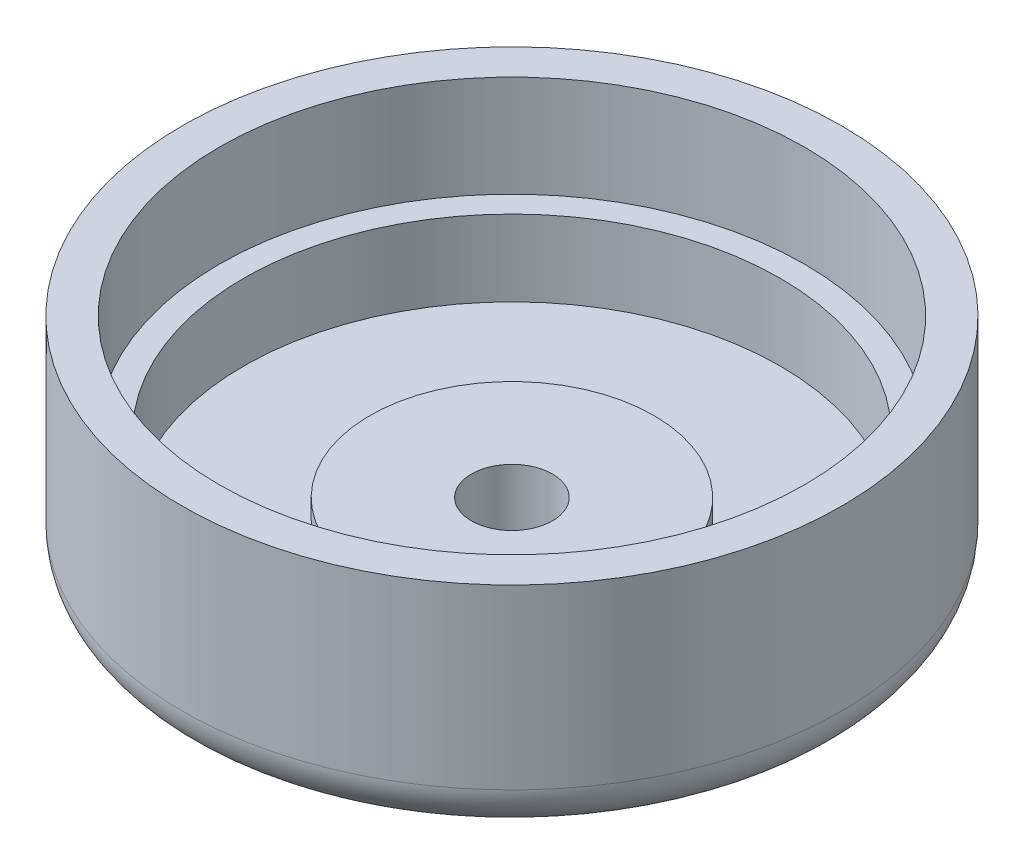
ISO-10303-21;
HEADER;
FILE_DESCRIPTION(('STEP AP214'),'2;1');
FILE_NAME('part.step','',(''),(''),'','','');
FILE_SCHEMA(('AUTOMOTIVE_DESIGN { 1 0 10303 214 1 1 1 1 }'));
ENDSEC;
DATA;
#1=APPLICATION_CONTEXT('core data for automotive mechanical design processes');
#2=APPLICATION_PROTOCOL_DEFINITION('international standard','automotive_design',2000,#1);
#3=PRODUCT_CONTEXT('',#1,'mechanical');
#4=PRODUCT('Part','Part','',(#3));
#5=PRODUCT_RELATED_PRODUCT_CATEGORY('part','',(#4));
#6=PRODUCT_DEFINITION_FORMATION('','',#4);
#7=PRODUCT_DEFINITION_CONTEXT('part definition',#1,'design');
#8=PRODUCT_DEFINITION('design','',#6,#7);
#9=PRODUCT_DEFINITION_SHAPE('','',#8);
#10=(LENGTH_UNIT() NAMED_UNIT(*) SI_UNIT(.MILLI.,.METRE.));
#11=(NAMED_UNIT(*) PLANE_ANGLE_UNIT() SI_UNIT($,.RADIAN.));
#12=(NAMED_UNIT(*) SI_UNIT($,.STERADIAN.) SOLID_ANGLE_UNIT());
#13=UNCERTAINTY_MEASURE_WITH_UNIT(LENGTH_MEASURE(1.E-05),#10,'distance_accuracy_value','');
#14=(GEOMETRIC_REPRESENTATION_CONTEXT(3) GLOBAL_UNCERTAINTY_ASSIGNED_CONTEXT((#13)) GLOBAL_UNIT_ASSIGNED_CONTEXT((#10,
#11,#12)) REPRESENTATION_CONTEXT('',''));
#15=CARTESIAN_POINT('',(0.,0.,0.));
#16=DIRECTION('',(0.,0.,1.));
#17=DIRECTION('',(1.,0.,0.));
#18=AXIS2_PLACEMENT_3D('',#15,#16,#17);
#19=CARTESIAN_POINT('',(0.,0.,0.));
#20=DIRECTION('',(0.,-1.,0.));
#21=DIRECTION('',(0.,0.,-1.));
#22=AXIS2_PLACEMENT_3D('',#19,#20,#21);
#23=CYLINDRICAL_SURFACE('',#22,4.);
#24=CARTESIAN_POINT('',(0.,0.,0.));
#25=DIRECTION('',(0.,-1.,0.));
#26=DIRECTION('',(0.,0.,-1.));
#27=AXIS2_PLACEMENT_3D('',#24,#25,#26);
#28=CIRCLE('',#27,4.);
#29=CARTESIAN_POINT('',(0.,0.,-4.));
#30=VERTEX_POINT('',#29);
#31=EDGE_CURVE('E69',#30,#30,#28,.T.);
#32=ORIENTED_EDGE('',*,*,#31,.T.);
#33=EDGE_LOOP('',(#32));
#34=FACE_BOUND('',#33,.T.);
#35=CARTESIAN_POINT('',(0.,6.5,0.));
#36=DIRECTION('',(0.,-1.,0.));
#37=DIRECTION('',(0.,0.,-1.));
#38=AXIS2_PLACEMENT_3D('',#35,#36,#37);
#39=CIRCLE('',#38,4.);
#40=CARTESIAN_POINT('',(0.,6.5,-4.));
#41=VERTEX_POINT('',#40);
#42=EDGE_CURVE('E42',#41,#41,#39,.T.);
#43=ORIENTED_EDGE('',*,*,#42,.F.);
#44=EDGE_LOOP('',(#43));
#45=FACE_BOUND('',#44,.T.);
#46=ADVANCED_FACE('F31',(#34,#45),#23,.F.);
#47=CARTESIAN_POINT('',(4.,6.5,0.));
#48=DIRECTION('',(0.,1.,0.));
#49=DIRECTION('',(0.,0.,1.));
#50=AXIS2_PLACEMENT_3D('',#47,#48,#49);
#51=PLANE('',#50);
#52=ORIENTED_EDGE('',*,*,#42,.T.);
#53=EDGE_LOOP('',(#52));
#54=FACE_BOUND('',#53,.T.);
#55=CARTESIAN_POINT('',(0.,6.5,0.));
#56=DIRECTION('',(0.,-1.,0.));
#57=DIRECTION('',(0.,0.,-1.));
#58=AXIS2_PLACEMENT_3D('',#55,#56,#57);
#59=CIRCLE('',#58,14.);
#60=CARTESIAN_POINT('',(0.,6.5,-14.));
#61=VERTEX_POINT('',#60);
#62=EDGE_CURVE('E46',#61,#61,#59,.T.);
#63=ORIENTED_EDGE('',*,*,#62,.F.);
#64=EDGE_LOOP('',(#63));
#65=FACE_BOUND('',#64,.T.);
#66=ADVANCED_FACE('F87',(#54,#65),#51,.T.);
#67=CARTESIAN_POINT('',(0.,0.,0.));
#68=DIRECTION('',(0.,-1.,0.));
#69=DIRECTION('',(0.,0.,-1.));
#70=AXIS2_PLACEMENT_3D('',#67,#68,#69);
#71=CYLINDRICAL_SURFACE('',#70,14.);
#72=ORIENTED_EDGE('',*,*,#62,.T.);
#73=EDGE_LOOP('',(#72));
#74=FACE_BOUND('',#73,.T.);
#75=CARTESIAN_POINT('',(0.,4.5,0.));
#76=DIRECTION('',(0.,-1.,0.));
#77=DIRECTION('',(0.,0.,-1.));
#78=AXIS2_PLACEMENT_3D('',#75,#76,#77);
#79=CIRCLE('',#78,14.);
#80=CARTESIAN_POINT('',(0.,4.5,-14.));
#81=VERTEX_POINT('',#80);
#82=EDGE_CURVE('E51',#81,#81,#79,.T.);
#83=ORIENTED_EDGE('',*,*,#82,.F.);
#84=EDGE_LOOP('',(#83));
#85=FACE_BOUND('',#84,.T.);
#86=ADVANCED_FACE('F91',(#74,#85),#71,.T.);
#87=CARTESIAN_POINT('',(14.,4.5,0.));
#88=DIRECTION('',(0.,1.,0.));
#89=DIRECTION('',(0.,0.,1.));
#90=AXIS2_PLACEMENT_3D('',#87,#88,#89);
#91=PLANE('',#90);
#92=ORIENTED_EDGE('',*,*,#82,.T.);
#93=EDGE_LOOP('',(#92));
#94=FACE_BOUND('',#93,.T.);
#95=CARTESIAN_POINT('',(0.,4.5,0.));
#96=DIRECTION('',(0.,-1.,0.));
#97=DIRECTION('',(0.,0.,-1.));
#98=AXIS2_PLACEMENT_3D('',#95,#96,#97);
#99=CIRCLE('',#98,26.45);
#100=CARTESIAN_POINT('',(0.,4.5,-26.45));
#101=VERTEX_POINT('',#100);
#102=EDGE_CURVE('E54',#101,#101,#99,.T.);
#103=ORIENTED_EDGE('',*,*,#102,.F.);
#104=EDGE_LOOP('',(#103));
#105=FACE_BOUND('',#104,.T.);
#106=ADVANCED_FACE('F97',(#94,#105),#91,.T.);
#107=CARTESIAN_POINT('',(0.,0.,0.));
#108=DIRECTION('',(0.,-1.,0.));
#109=DIRECTION('',(0.,0.,-1.));
#110=AXIS2_PLACEMENT_3D('',#107,#108,#109);
#111=CYLINDRICAL_SURFACE('',#110,26.45);
#112=ORIENTED_EDGE('',*,*,#102,.T.);
#113=EDGE_LOOP('',(#112));
#114=FACE_BOUND('',#113,.T.);
#115=CARTESIAN_POINT('',(0.,12.,0.));
#116=DIRECTION('',(0.,-1.,0.));
#117=DIRECTION('',(0.,0.,-1.));
#118=AXIS2_PLACEMENT_3D('',#115,#116,#117);
#119=CIRCLE('',#118,26.45);
#120=CARTESIAN_POINT('',(0.,12.,-26.45));
#121=VERTEX_POINT('',#120);
#122=EDGE_CURVE('E57',#121,#121,#119,.T.);
#123=ORIENTED_EDGE('',*,*,#122,.F.);
#124=EDGE_LOOP('',(#123));
#125=FACE_BOUND('',#124,.T.);
#126=ADVANCED_FACE('F101',(#114,#125),#111,.F.);
#127=CARTESIAN_POINT('',(28.85,12.,0.));
#128=DIRECTION('',(0.,1.,0.));
#129=DIRECTION('',(0.,0.,1.));
#130=AXIS2_PLACEMENT_3D('',#127,#128,#129);
#131=PLANE('',#130);
#132=ORIENTED_EDGE('',*,*,#122,.T.);
#133=EDGE_LOOP('',(#132));
#134=FACE_BOUND('',#133,.T.);
#135=CARTESIAN_POINT('',(0.,12.,0.));
#136=DIRECTION('',(0.,-1.,0.));
#137=DIRECTION('',(0.,0.,-1.));
#138=AXIS2_PLACEMENT_3D('',#135,#136,#137);
#139=CIRCLE('',#138,28.85);
#140=CARTESIAN_POINT('',(0.,12.,-28.85));
#141=VERTEX_POINT('',#140);
#142=EDGE_CURVE('E60',#141,#141,#139,.T.);
#143=ORIENTED_EDGE('',*,*,#142,.F.);
#144=EDGE_LOOP('',(#143));
#145=FACE_BOUND('',#144,.T.);
#146=ADVANCED_FACE('F105',(#134,#145),#131,.T.);
#147=CARTESIAN_POINT('',(0.,0.,0.));
#148=DIRECTION('',(0.,-1.,0.));
#149=DIRECTION('',(0.,0.,-1.));
#150=AXIS2_PLACEMENT_3D('',#147,#148,#149);
#151=CYLINDRICAL_SURFACE('',#150,28.85);
#152=ORIENTED_EDGE('',*,*,#142,.T.);
#153=EDGE_LOOP('',(#152));
#154=FACE_BOUND('',#153,.T.);
#155=CARTESIAN_POINT('',(0.,22.,0.));
#156=DIRECTION('',(0.,-1.,0.));
#157=DIRECTION('',(0.,0.,-1.));
#158=AXIS2_PLACEMENT_3D('',#155,#156,#157);
#159=CIRCLE('',#158,28.85);
#160=CARTESIAN_POINT('',(0.,22.,-28.85));
#161=VERTEX_POINT('',#160);
#162=EDGE_CURVE('E63',#161,#161,#159,.T.);
#163=ORIENTED_EDGE('',*,*,#162,.F.);
#164=EDGE_LOOP('',(#163));
#165=FACE_BOUND('',#164,.T.);
#166=ADVANCED_FACE('F109',(#154,#165),#151,.F.);
#167=CARTESIAN_POINT('',(32.5,22.,0.));
#168=DIRECTION('',(0.,1.,0.));
#169=DIRECTION('',(0.,0.,1.));
#170=AXIS2_PLACEMENT_3D('',#167,#168,#169);
#171=PLANE('',#170);
#172=ORIENTED_EDGE('',*,*,#162,.T.);
#173=EDGE_LOOP('',(#172));
#174=FACE_BOUND('',#173,.T.);
#175=CARTESIAN_POINT('',(0.,22.,0.));
#176=DIRECTION('',(0.,-1.,0.));
#177=DIRECTION('',(0.,0.,-1.));
#178=AXIS2_PLACEMENT_3D('',#175,#176,#177);
#179=CIRCLE('',#178,32.5);
#180=CARTESIAN_POINT('',(0.,22.,-32.5));
#181=VERTEX_POINT('',#180);
#182=EDGE_CURVE('E66',#181,#181,#179,.T.);
#183=ORIENTED_EDGE('',*,*,#182,.F.);
#184=EDGE_LOOP('',(#183));
#185=FACE_BOUND('',#184,.T.);
#186=ADVANCED_FACE('F84',(#174,#185),#171,.T.);
#187=CARTESIAN_POINT('',(0.,0.,0.));
#188=DIRECTION('',(0.,-1.,0.));
#189=DIRECTION('',(0.,0.,-1.));
#190=AXIS2_PLACEMENT_3D('',#187,#188,#189);
#191=CYLINDRICAL_SURFACE('',#190,32.5);
#192=CARTESIAN_POINT('',(0.,4.5,0.));
#193=DIRECTION('',(0.,-1.,0.));
#194=DIRECTION('',(0.,0.,-1.));
#195=AXIS2_PLACEMENT_3D('',#192,#193,#194);
#196=CIRCLE('',#195,32.5);
#197=CARTESIAN_POINT('',(0.,4.5,-32.5));
#198=VERTEX_POINT('',#197);
#199=EDGE_CURVE('E10',#198,#198,#196,.F.);
#200=ORIENTED_EDGE('',*,*,#199,.T.);
#201=EDGE_LOOP('',(#200));
#202=FACE_BOUND('',#201,.T.);
#203=ORIENTED_EDGE('',*,*,#182,.T.);
#204=EDGE_LOOP('',(#203));
#205=FACE_BOUND('',#204,.T.);
#206=ADVANCED_FACE('F77',(#202,#205),#191,.T.);
#207=CARTESIAN_POINT('',(4.,0.,0.));
#208=DIRECTION('',(0.,-1.,0.));
#209=DIRECTION('',(0.,0.,-1.));
#210=AXIS2_PLACEMENT_3D('',#207,#208,#209);
#211=PLANE('',#210);
#212=CARTESIAN_POINT('',(0.,0.,0.));
#213=DIRECTION('',(0.,-1.,0.));
#214=DIRECTION('',(0.,0.,-1.));
#215=AXIS2_PLACEMENT_3D('',#212,#213,#214);
#216=CIRCLE('',#215,28.);
#217=CARTESIAN_POINT('',(0.,0.,-28.));
#218=VERTEX_POINT('',#217);
#219=EDGE_CURVE('E38',#218,#218,#216,.T.);
#220=ORIENTED_EDGE('',*,*,#219,.T.);
#221=EDGE_LOOP('',(#220));
#222=FACE_BOUND('',#221,.T.);
#223=ORIENTED_EDGE('',*,*,#31,.F.);
#224=EDGE_LOOP('',(#223));
#225=FACE_BOUND('',#224,.T.);
#226=ADVANCED_FACE('F75',(#222,#225),#211,.T.);
#227=CARTESIAN_POINT('',(0.,4.5,0.));
#228=DIRECTION('',(0.,-1.,0.));
#229=DIRECTION('',(0.,0.,-1.));
#230=AXIS2_PLACEMENT_3D('',#227,#228,#229);
#231=TOROIDAL_SURFACE('',#230,28.,4.5);
#232=ORIENTED_EDGE('',*,*,#199,.F.);
#233=EDGE_LOOP('',(#232));
#234=FACE_BOUND('',#233,.T.);
#235=ORIENTED_EDGE('',*,*,#219,.F.);
#236=EDGE_LOOP('',(#235));
#237=FACE_BOUND('',#236,.T.);
#238=ADVANCED_FACE('F33',(#234,#237),#231,.T.);
#239=CLOSED_SHELL('',(#46,#66,#86,#106,#126,#146,#166,#186,#206,#226,#238));
#240=MANIFOLD_SOLID_BREP('B2',#239);
#241=ADVANCED_BREP_SHAPE_REPRESENTATION('',(#18,#240),#14);
#242=SHAPE_DEFINITION_REPRESENTATION(#9,#241);
ENDSEC;
END-ISO-10303-21;
